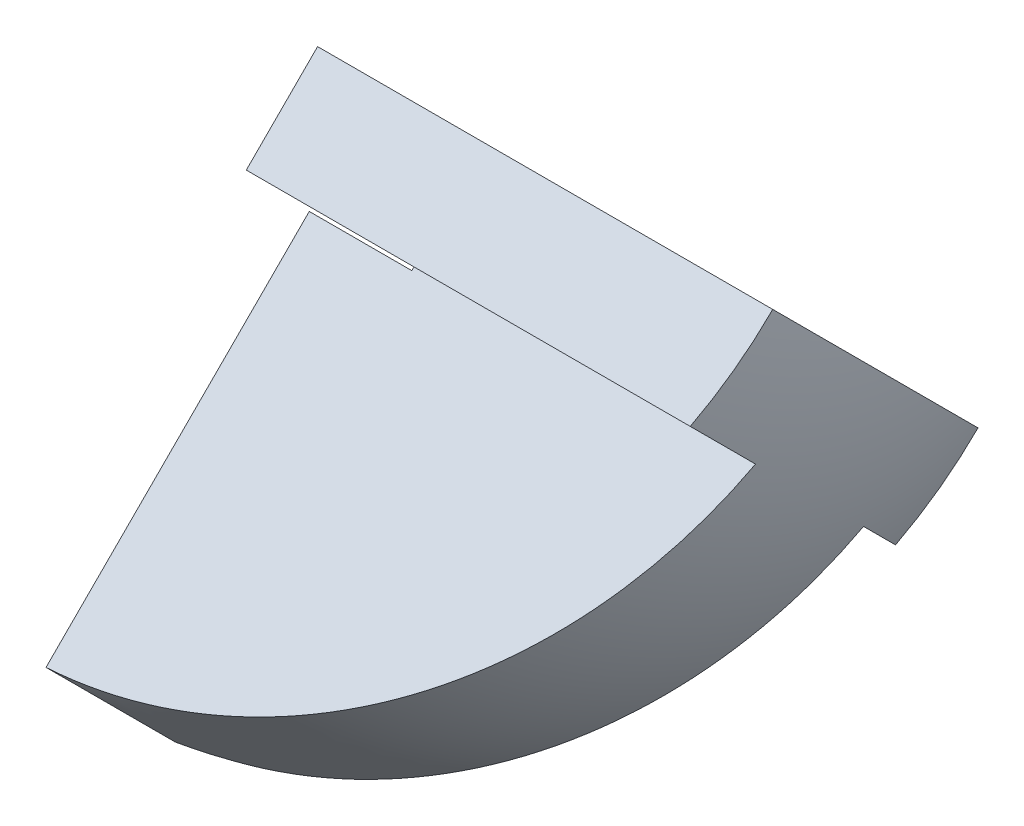
ISO-10303-21;
HEADER;
FILE_DESCRIPTION(('STEP AP214'),'2;1');
FILE_NAME('part.step','',(''),(''),'','','');
FILE_SCHEMA(('AUTOMOTIVE_DESIGN { 1 0 10303 214 1 1 1 1 }'));
ENDSEC;
DATA;
#1=APPLICATION_CONTEXT('core data for automotive mechanical design processes');
#2=APPLICATION_PROTOCOL_DEFINITION('international standard','automotive_design',2000,#1);
#3=PRODUCT_CONTEXT('',#1,'mechanical');
#4=PRODUCT('Part','Part','',(#3));
#5=PRODUCT_RELATED_PRODUCT_CATEGORY('part','',(#4));
#6=PRODUCT_DEFINITION_FORMATION('','',#4);
#7=PRODUCT_DEFINITION_CONTEXT('part definition',#1,'design');
#8=PRODUCT_DEFINITION('design','',#6,#7);
#9=PRODUCT_DEFINITION_SHAPE('','',#8);
#10=(LENGTH_UNIT() NAMED_UNIT(*) SI_UNIT(.MILLI.,.METRE.));
#11=(NAMED_UNIT(*) PLANE_ANGLE_UNIT() SI_UNIT($,.RADIAN.));
#12=(NAMED_UNIT(*) SI_UNIT($,.STERADIAN.) SOLID_ANGLE_UNIT());
#13=UNCERTAINTY_MEASURE_WITH_UNIT(LENGTH_MEASURE(1.E-05),#10,'distance_accuracy_value','');
#14=(GEOMETRIC_REPRESENTATION_CONTEXT(3) GLOBAL_UNCERTAINTY_ASSIGNED_CONTEXT((#13)) GLOBAL_UNIT_ASSIGNED_CONTEXT((#10,
#11,#12)) REPRESENTATION_CONTEXT('',''));
#15=CARTESIAN_POINT('',(0.,0.,0.));
#16=DIRECTION('',(0.,0.,1.));
#17=DIRECTION('',(1.,0.,0.));
#18=AXIS2_PLACEMENT_3D('',#15,#16,#17);
#19=CARTESIAN_POINT('',(-65.,-21.4342694425522,76.0704710401193));
#20=DIRECTION('',(0.,1.,0.));
#21=DIRECTION('',(0.,0.,-1.));
#22=AXIS2_PLACEMENT_3D('',#19,#20,#21);
#23=SPHERICAL_SURFACE('',#22,19.75);
#24=CARTESIAN_POINT('',(-65.,-24.3510849149467,78.9872865125137));
#25=DIRECTION('',(0.,-0.707106781186555,0.70710678118654));
#26=DIRECTION('',(0.,-0.70710678118654,-0.707106781186555));
#27=AXIS2_PLACEMENT_3D('',#24,#25,#26);
#28=CIRCLE('',#27,19.3144214254531);
#29=CARTESIAN_POINT('',(-46.6207509822457,-20.1528662127245,83.185505214736));
#30=VERTEX_POINT('',#29);
#31=CARTESIAN_POINT('',(-45.9400616475289,-22.1413762237388,81.1969952037217));
#32=VERTEX_POINT('',#31);
#33=EDGE_CURVE('E178',#30,#32,#28,.F.);
#34=ORIENTED_EDGE('',*,*,#33,.T.);
#35=CARTESIAN_POINT('',(-65.,-19.2245607513442,78.2801797313273));
#36=DIRECTION('',(0.,0.70710678118654,0.707106781186555));
#37=DIRECTION('',(0.,-0.707106781186555,0.70710678118654));
#38=AXIS2_PLACEMENT_3D('',#35,#36,#37);
#39=CIRCLE('',#38,19.5012018860377);
#40=CARTESIAN_POINT('',(-64.107321446432,-32.9995380653003,92.0551570452831));
#41=VERTEX_POINT('',#40);
#42=EDGE_CURVE('E185',#32,#41,#39,.F.);
#43=ORIENTED_EDGE('',*,*,#42,.T.);
#44=CARTESIAN_POINT('',(-65.,-35.2092467565082,89.8454483540751));
#45=DIRECTION('',(0.,0.707106781186551,-0.707106781186544));
#46=DIRECTION('',(0.,0.707106781186544,0.707106781186551));
#47=AXIS2_PLACEMENT_3D('',#44,#45,#46);
#48=CIRCLE('',#47,3.25000000000001);
#49=CARTESIAN_POINT('',(-64.1087574721216,-37.4192452583744,87.635449852209));
#50=VERTEX_POINT('',#49);
#51=EDGE_CURVE('E202',#50,#41,#48,.F.);
#52=ORIENTED_EDGE('',*,*,#51,.F.);
#53=CARTESIAN_POINT('',(-65.,-23.5919807676195,73.898563616899));
#54=DIRECTION('',(0.,-0.704784507451607,-0.709421453056077));
#55=DIRECTION('',(0.,0.709421453056077,-0.704784507451607));
#56=AXIS2_PLACEMENT_3D('',#53,#54,#55);
#57=CIRCLE('',#56,19.5112685385302);
#58=CARTESIAN_POINT('',(-62.6227242619556,-37.3305671000678,87.5473513152188));
#59=VERTEX_POINT('',#58);
#60=EDGE_CURVE('E196',#50,#59,#57,.F.);
#61=ORIENTED_EDGE('',*,*,#60,.T.);
#62=CARTESIAN_POINT('',(-65.,-23.6439781337602,73.8607623489113));
#63=DIRECTION('',(0.,-0.707106781186544,-0.707106781186551));
#64=DIRECTION('',(0.,0.707106781186551,-0.707106781186544));
#65=AXIS2_PLACEMENT_3D('',#62,#63,#64);
#66=CIRCLE('',#65,19.5012018860377);
#67=CARTESIAN_POINT('',(-45.9400616475289,-26.5607936061547,76.7775778213058));
#68=VERTEX_POINT('',#67);
#69=EDGE_CURVE('E193',#59,#68,#66,.F.);
#70=ORIENTED_EDGE('',*,*,#69,.T.);
#71=CARTESIAN_POINT('',(-65.,-24.3510849149467,78.9872865125138));
#72=DIRECTION('',(0.,-0.70710678118655,0.707106781186545));
#73=DIRECTION('',(0.,-0.707106781186545,-0.70710678118655));
#74=AXIS2_PLACEMENT_3D('',#71,#72,#73);
#75=CIRCLE('',#74,19.3144214254531);
#76=CARTESIAN_POINT('',(-46.6207509822457,-28.549303617169,74.7890678102915));
#77=VERTEX_POINT('',#76);
#78=EDGE_CURVE('E137',#68,#77,#75,.F.);
#79=ORIENTED_EDGE('',*,*,#78,.T.);
#80=CARTESIAN_POINT('',(-65.,-25.6324881447745,71.872252337897));
#81=DIRECTION('',(0.,-0.707106781186547,-0.707106781186547));
#82=DIRECTION('',(0.,0.707106781186548,-0.707106781186548));
#83=AXIS2_PLACEMENT_3D('',#80,#81,#82);
#84=CIRCLE('',#83,18.8364651529055);
#85=CARTESIAN_POINT('',(-46.1635348470945,-25.6324881447745,71.8722523378971));
#86=VERTEX_POINT('',#85);
#87=EDGE_CURVE('E124',#77,#86,#84,.F.);
#88=ORIENTED_EDGE('',*,*,#87,.T.);
#89=CARTESIAN_POINT('',(-65.,-21.4342694425522,76.0704710401193));
#90=DIRECTION('',(0.,-0.707106781186551,0.707106781186544));
#91=DIRECTION('',(0.,-0.707106781186544,-0.707106781186551));
#92=AXIS2_PLACEMENT_3D('',#89,#90,#91);
#93=CIRCLE('',#92,19.75);
#94=CARTESIAN_POINT('',(-46.1635348470945,-17.23605074033,80.2686897423416));
#95=VERTEX_POINT('',#94);
#96=EDGE_CURVE('E130',#95,#86,#93,.F.);
#97=ORIENTED_EDGE('',*,*,#96,.F.);
#98=CARTESIAN_POINT('',(-65.,-17.23605074033,80.2686897423416));
#99=DIRECTION('',(0.,0.707106781186543,0.707106781186552));
#100=DIRECTION('',(0.,-0.707106781186552,0.707106781186543));
#101=AXIS2_PLACEMENT_3D('',#98,#99,#100);
#102=CIRCLE('',#101,18.8364651529055);
#103=EDGE_CURVE('E57',#95,#30,#102,.F.);
#104=ORIENTED_EDGE('',*,*,#103,.T.);
#105=EDGE_LOOP('',(#34,#43,#52,#61,#70,#79,#88,#97,#104));
#106=FACE_BOUND('',#105,.T.);
#107=ADVANCED_FACE('F35',(#106),#23,.T.);
#108=CARTESIAN_POINT('',(-65.,-41.1842694425523,95.8204710401192));
#109=DIRECTION('',(0.,0.707106781186551,-0.707106781186544));
#110=DIRECTION('',(0.,0.707106781186544,0.707106781186551));
#111=AXIS2_PLACEMENT_3D('',#108,#109,#110);
#112=CYLINDRICAL_SURFACE('',#111,3.25000000000001);
#113=DIRECTION('',(0.,0.707106781186551,-0.707106781186544));
#114=VECTOR('',#113,1.);
#115=CARTESIAN_POINT('',(-64.107321446432,-38.9745607513444,98.0301797313271));
#116=LINE('',#115,#114);
#117=CARTESIAN_POINT('',(-64.1073214464324,-22.2297645713871,81.2853835513701));
#118=VERTEX_POINT('',#117);
#119=EDGE_CURVE('E183',#118,#41,#116,.F.);
#120=ORIENTED_EDGE('',*,*,#119,.F.);
#121=CARTESIAN_POINT('',(-65.,-24.4394732625951,79.0756748601621));
#122=DIRECTION('',(0.,0.707106781186552,-0.707106781186543));
#123=DIRECTION('',(0.,0.707106781186543,0.707106781186552));
#124=AXIS2_PLACEMENT_3D('',#121,#122,#123);
#125=CIRCLE('',#124,3.25000000000001);
#126=CARTESIAN_POINT('',(-64.1073214464322,-26.649181953803,76.8659661689541));
#127=VERTEX_POINT('',#126);
#128=EDGE_CURVE('E199',#118,#127,#125,.T.);
#129=ORIENTED_EDGE('',*,*,#128,.T.);
#130=DIRECTION('',(0.,0.707106781186551,-0.707106781186544));
#131=VECTOR('',#130,1.);
#132=CARTESIAN_POINT('',(-64.1073214464321,-43.3939781337603,93.6107623489112));
#133=LINE('',#132,#131);
#134=CARTESIAN_POINT('',(-64.1073214464321,-37.3305671000678,87.5473513152188));
#135=VERTEX_POINT('',#134);
#136=EDGE_CURVE('E191',#135,#127,#133,.T.);
#137=ORIENTED_EDGE('',*,*,#136,.F.);
#138=CARTESIAN_POINT('',(-65.,638.810532782176,-584.174331184602));
#139=DIRECTION('',(0.,-0.704784507451607,-0.709421453056077));
#140=DIRECTION('',(0.,0.709421453056077,-0.704784507451607));
#141=AXIS2_PLACEMENT_3D('',#138,#139,#140);
#142=ELLIPSE('',#141,991.211558162383,3.25000000000001);
#143=EDGE_CURVE('E12',#50,#135,#142,.F.);
#144=ORIENTED_EDGE('',*,*,#143,.F.);
#145=ORIENTED_EDGE('',*,*,#51,.T.);
#146=EDGE_LOOP('',(#120,#129,#137,#144,#145));
#147=FACE_BOUND('',#146,.T.);
#148=ADVANCED_FACE('F250',(#147),#112,.F.);
#149=CARTESIAN_POINT('',(0.,-51.7575740613788,51.7575740613781));
#150=DIRECTION('',(0.,0.707106781186552,-0.707106781186543));
#151=DIRECTION('',(0.,0.707106781186543,0.707106781186552));
#152=AXIS2_PLACEMENT_3D('',#149,#150,#151);
#153=PLANE('',#152);
#154=ORIENTED_EDGE('',*,*,#128,.F.);
#155=DIRECTION('',(1.,0.,0.));
#156=VECTOR('',#155,1.);
#157=CARTESIAN_POINT('',(0.,-22.2297645713871,81.2853835513702));
#158=LINE('',#157,#156);
#159=CARTESIAN_POINT('',(-59.9126587736529,-22.2297645713871,81.2853835513701));
#160=VERTEX_POINT('',#159);
#161=EDGE_CURVE('E180',#118,#160,#158,.T.);
#162=ORIENTED_EDGE('',*,*,#161,.T.);
#163=DIRECTION('',(0.866025403784439,-0.353553390593271,-0.353553390593275));
#164=VECTOR('',#163,1.);
#165=CARTESIAN_POINT('',(-65.,-20.1528662127245,83.3622819100327));
#166=LINE('',#165,#164);
#167=CARTESIAN_POINT('',(-59.75,-22.2961697376598,81.2189783850974));
#168=VERTEX_POINT('',#167);
#169=EDGE_CURVE('E208',#160,#168,#166,.T.);
#170=ORIENTED_EDGE('',*,*,#169,.T.);
#171=DIRECTION('',(0.,-0.707106781186545,-0.70710678118655));
#172=VECTOR('',#171,1.);
#173=CARTESIAN_POINT('',(-59.75,-22.2961697376598,81.2189783850974));
#174=LINE('',#173,#172);
#175=CARTESIAN_POINT('',(-59.75,-26.5827767875304,76.9323713352268));
#176=VERTEX_POINT('',#175);
#177=EDGE_CURVE('E211',#168,#176,#174,.T.);
#178=ORIENTED_EDGE('',*,*,#177,.T.);
#179=DIRECTION('',(-0.866025403784439,-0.353553390593271,-0.353553390593277));
#180=VECTOR('',#179,1.);
#181=CARTESIAN_POINT('',(-59.75,-26.5827767875304,76.9323713352268));
#182=LINE('',#181,#180);
#183=CARTESIAN_POINT('',(-59.9126587736527,-26.649181953803,76.8659661689541));
#184=VERTEX_POINT('',#183);
#185=EDGE_CURVE('E205',#176,#184,#182,.T.);
#186=ORIENTED_EDGE('',*,*,#185,.T.);
#187=DIRECTION('',(-1.,0.,0.));
#188=VECTOR('',#187,1.);
#189=CARTESIAN_POINT('',(0.,-26.6491819538031,76.8659661689542));
#190=LINE('',#189,#188);
#191=EDGE_CURVE('E188',#184,#127,#190,.T.);
#192=ORIENTED_EDGE('',*,*,#191,.T.);
#193=EDGE_LOOP('',(#154,#162,#170,#178,#186,#192));
#194=FACE_BOUND('',#193,.T.);
#195=ADVANCED_FACE('F227',(#194),#153,.T.);
#196=CARTESIAN_POINT('',(-59.75,-26.5827767875304,76.9323713352268));
#197=DIRECTION('',(0.5,-0.612372435695791,-0.612372435695798));
#198=DIRECTION('',(0.,0.707106781186551,-0.707106781186544));
#199=AXIS2_PLACEMENT_3D('',#196,#197,#198);
#200=PLANE('',#199);
#201=DIRECTION('',(0.,0.707106781186548,-0.707106781186548));
#202=VECTOR('',#201,1.);
#203=CARTESIAN_POINT('',(-64.7834936490538,-28.6376919648173,74.8774561579399));
#204=LINE('',#203,#202);
#205=CARTESIAN_POINT('',(-64.7834936490539,-28.549303617169,74.7890678102915));
#206=VERTEX_POINT('',#205);
#207=CARTESIAN_POINT('',(-64.7834936490539,-25.6324881447745,71.872252337897));
#208=VERTEX_POINT('',#207);
#209=EDGE_CURVE('E49',#206,#208,#204,.T.);
#210=ORIENTED_EDGE('',*,*,#209,.F.);
#211=DIRECTION('',(-0.866025403784439,-0.353553390593273,-0.353553390593275));
#212=VECTOR('',#211,1.);
#213=CARTESIAN_POINT('',(-59.75,-26.494388439882,76.8439829875785));
#214=LINE('',#213,#212);
#215=CARTESIAN_POINT('',(-59.9126587736527,-26.5607936061547,76.7775778213058));
#216=VERTEX_POINT('',#215);
#217=EDGE_CURVE('E42',#216,#206,#214,.T.);
#218=ORIENTED_EDGE('',*,*,#217,.F.);
#219=DIRECTION('',(0.,0.707106781186551,-0.707106781186544));
#220=VECTOR('',#219,1.);
#221=CARTESIAN_POINT('',(-59.9126587736527,-26.649181953803,76.8659661689541));
#222=LINE('',#221,#220);
#223=EDGE_CURVE('E154',#184,#216,#222,.T.);
#224=ORIENTED_EDGE('',*,*,#223,.F.);
#225=ORIENTED_EDGE('',*,*,#185,.F.);
#226=DIRECTION('',(0.,0.707106781186551,-0.707106781186544));
#227=VECTOR('',#226,1.);
#228=CARTESIAN_POINT('',(-59.75,-26.5827767875304,76.9323713352268));
#229=LINE('',#228,#227);
#230=CARTESIAN_POINT('',(-59.75,-23.5775729674875,73.927167515184));
#231=VERTEX_POINT('',#230);
#232=EDGE_CURVE('E142',#176,#231,#229,.T.);
#233=ORIENTED_EDGE('',*,*,#232,.T.);
#234=DIRECTION('',(-0.866025403784439,-0.353553390593271,-0.353553390593277));
#235=VECTOR('',#234,1.);
#236=CARTESIAN_POINT('',(-59.75,-23.5775729674875,73.927167515184));
#237=LINE('',#236,#235);
#238=EDGE_CURVE('E167',#231,#208,#237,.T.);
#239=ORIENTED_EDGE('',*,*,#238,.T.);
#240=EDGE_LOOP('',(#210,#218,#224,#225,#233,#239));
#241=FACE_BOUND('',#240,.T.);
#242=ADVANCED_FACE('F166',(#241),#200,.F.);
#243=CARTESIAN_POINT('',(-65.,-20.1528662127245,83.3622819100327));
#244=DIRECTION('',(0.499999999999999,0.612372435695791,0.612372435695798));
#245=DIRECTION('',(0.,-0.707106781186551,0.707106781186544));
#246=AXIS2_PLACEMENT_3D('',#243,#244,#245);
#247=PLANE('',#246);
#248=DIRECTION('',(0.,-0.707106781186555,0.70710678118654));
#249=VECTOR('',#248,1.);
#250=CARTESIAN_POINT('',(-59.9126587736529,-22.229764571387,81.2853835513701));
#251=LINE('',#250,#249);
#252=CARTESIAN_POINT('',(-59.9126587736527,-22.1413762237388,81.1969952037217));
#253=VERTEX_POINT('',#252);
#254=EDGE_CURVE('E152',#253,#160,#251,.T.);
#255=ORIENTED_EDGE('',*,*,#254,.F.);
#256=DIRECTION('',(0.866025403784439,-0.35355339059327,-0.353553390593277));
#257=VECTOR('',#256,1.);
#258=CARTESIAN_POINT('',(-65.,-20.0644778650762,83.2738935623844));
#259=LINE('',#258,#257);
#260=CARTESIAN_POINT('',(-64.7834936490539,-20.1528662127245,83.185505214736));
#261=VERTEX_POINT('',#260);
#262=EDGE_CURVE('E150',#261,#253,#259,.T.);
#263=ORIENTED_EDGE('',*,*,#262,.F.);
#264=DIRECTION('',(0.,-0.707106781186552,0.707106781186543));
#265=VECTOR('',#264,1.);
#266=CARTESIAN_POINT('',(-64.7834936490539,-20.2412545603729,83.2738935623844));
#267=LINE('',#266,#265);
#268=CARTESIAN_POINT('',(-64.7834936490539,-17.23605074033,80.2686897423416));
#269=VERTEX_POINT('',#268);
#270=EDGE_CURVE('E138',#269,#261,#267,.T.);
#271=ORIENTED_EDGE('',*,*,#270,.F.);
#272=DIRECTION('',(0.866025403784439,-0.353553390593271,-0.353553390593275));
#273=VECTOR('',#272,1.);
#274=CARTESIAN_POINT('',(-65.,-17.1476623926817,80.3570780899899));
#275=LINE('',#274,#273);
#276=CARTESIAN_POINT('',(-59.75,-19.290965917617,78.2137745650546));
#277=VERTEX_POINT('',#276);
#278=EDGE_CURVE('E215',#269,#277,#275,.T.);
#279=ORIENTED_EDGE('',*,*,#278,.T.);
#280=DIRECTION('',(0.,0.707106781186551,-0.707106781186544));
#281=VECTOR('',#280,1.);
#282=CARTESIAN_POINT('',(-59.75,-22.2961697376598,81.2189783850974));
#283=LINE('',#282,#281);
#284=EDGE_CURVE('E145',#168,#277,#283,.T.);
#285=ORIENTED_EDGE('',*,*,#284,.F.);
#286=ORIENTED_EDGE('',*,*,#169,.F.);
#287=EDGE_LOOP('',(#255,#263,#271,#279,#285,#286));
#288=FACE_BOUND('',#287,.T.);
#289=ADVANCED_FACE('F231',(#288),#247,.F.);
#290=CARTESIAN_POINT('',(-45.25,-17.1476623926817,80.3570780899899));
#291=DIRECTION('',(0.,-0.707106781186551,0.707106781186544));
#292=DIRECTION('',(0.,-0.707106781186544,-0.707106781186551));
#293=AXIS2_PLACEMENT_3D('',#290,#291,#292);
#294=PLANE('',#293);
#295=DIRECTION('',(-1.,0.,0.));
#296=VECTOR('',#295,1.);
#297=CARTESIAN_POINT('',(-45.25,-17.23605074033,80.2686897423416));
#298=LINE('',#297,#296);
#299=EDGE_CURVE('E129',#95,#269,#298,.T.);
#300=ORIENTED_EDGE('',*,*,#299,.F.);
#301=ORIENTED_EDGE('',*,*,#96,.T.);
#302=DIRECTION('',(1.,0.,0.));
#303=VECTOR('',#302,1.);
#304=CARTESIAN_POINT('',(-45.25,-25.6324881447745,71.872252337897));
#305=LINE('',#304,#303);
#306=EDGE_CURVE('E121',#208,#86,#305,.T.);
#307=ORIENTED_EDGE('',*,*,#306,.F.);
#308=ORIENTED_EDGE('',*,*,#238,.F.);
#309=DIRECTION('',(0.,-0.707106781186545,-0.70710678118655));
#310=VECTOR('',#309,1.);
#311=CARTESIAN_POINT('',(-59.75,-19.290965917617,78.2137745650546));
#312=LINE('',#311,#310);
#313=EDGE_CURVE('E209',#277,#231,#312,.T.);
#314=ORIENTED_EDGE('',*,*,#313,.F.);
#315=ORIENTED_EDGE('',*,*,#278,.F.);
#316=EDGE_LOOP('',(#300,#301,#307,#308,#314,#315));
#317=FACE_BOUND('',#316,.T.);
#318=ADVANCED_FACE('F140',(#317),#294,.F.);
#319=CARTESIAN_POINT('',(-59.75,-22.2961697376598,81.2189783850974));
#320=DIRECTION('',(1.,0.,0.));
#321=DIRECTION('',(0.,0.,-1.));
#322=AXIS2_PLACEMENT_3D('',#319,#320,#321);
#323=PLANE('',#322);
#324=ORIENTED_EDGE('',*,*,#313,.T.);
#325=ORIENTED_EDGE('',*,*,#232,.F.);
#326=ORIENTED_EDGE('',*,*,#177,.F.);
#327=ORIENTED_EDGE('',*,*,#284,.T.);
#328=EDGE_LOOP('',(#324,#325,#326,#327));
#329=FACE_BOUND('',#328,.T.);
#330=ADVANCED_FACE('F221',(#329),#323,.F.);
#331=CARTESIAN_POINT('',(-65.,-25.7208764924228,71.9606406855453));
#332=DIRECTION('',(0.,-0.707106781186547,-0.707106781186547));
#333=DIRECTION('',(0.,0.707106781186548,-0.707106781186548));
#334=AXIS2_PLACEMENT_3D('',#331,#332,#333);
#335=PLANE('',#334);
#336=DIRECTION('',(1.,0.,0.));
#337=VECTOR('',#336,1.);
#338=CARTESIAN_POINT('',(-65.,-28.549303617169,74.7890678102915));
#339=LINE('',#338,#337);
#340=EDGE_CURVE('E159',#206,#77,#339,.T.);
#341=ORIENTED_EDGE('',*,*,#340,.F.);
#342=ORIENTED_EDGE('',*,*,#209,.T.);
#343=ORIENTED_EDGE('',*,*,#306,.T.);
#344=ORIENTED_EDGE('',*,*,#87,.F.);
#345=EDGE_LOOP('',(#341,#342,#343,#344));
#346=FACE_BOUND('',#345,.T.);
#347=ADVANCED_FACE('F123',(#346),#335,.T.);
#348=CARTESIAN_POINT('',(-65.,-37.3305671000678,87.5473513152188));
#349=DIRECTION('',(0.,-0.707106781186544,-0.707106781186551));
#350=DIRECTION('',(0.,0.707106781186551,-0.707106781186544));
#351=AXIS2_PLACEMENT_3D('',#348,#349,#350);
#352=PLANE('',#351);
#353=DIRECTION('',(1.,0.,0.));
#354=VECTOR('',#353,1.);
#355=CARTESIAN_POINT('',(-65.,-37.3305671000678,87.5473513152188));
#356=LINE('',#355,#354);
#357=EDGE_CURVE('E173',#135,#59,#356,.T.);
#358=ORIENTED_EDGE('',*,*,#357,.F.);
#359=ORIENTED_EDGE('',*,*,#136,.T.);
#360=ORIENTED_EDGE('',*,*,#191,.F.);
#361=ORIENTED_EDGE('',*,*,#223,.T.);
#362=DIRECTION('',(1.,0.,0.));
#363=VECTOR('',#362,1.);
#364=CARTESIAN_POINT('',(-65.,-26.5607936061547,76.7775778213058));
#365=LINE('',#364,#363);
#366=EDGE_CURVE('E161',#216,#68,#365,.T.);
#367=ORIENTED_EDGE('',*,*,#366,.T.);
#368=ORIENTED_EDGE('',*,*,#69,.F.);
#369=EDGE_LOOP('',(#358,#359,#360,#361,#367,#368));
#370=FACE_BOUND('',#369,.T.);
#371=ADVANCED_FACE('F251',(#370),#352,.T.);
#372=CARTESIAN_POINT('',(-65.,-26.5607936061547,76.7775778213058));
#373=DIRECTION('',(0.,-0.70710678118655,0.707106781186545));
#374=DIRECTION('',(0.,-0.707106781186545,-0.70710678118655));
#375=AXIS2_PLACEMENT_3D('',#372,#373,#374);
#376=PLANE('',#375);
#377=ORIENTED_EDGE('',*,*,#366,.F.);
#378=ORIENTED_EDGE('',*,*,#217,.T.);
#379=ORIENTED_EDGE('',*,*,#340,.T.);
#380=ORIENTED_EDGE('',*,*,#78,.F.);
#381=EDGE_LOOP('',(#377,#378,#379,#380));
#382=FACE_BOUND('',#381,.T.);
#383=ADVANCED_FACE('F158',(#382),#376,.T.);
#384=CARTESIAN_POINT('',(-65.,-37.3305671000678,87.5473513152188));
#385=DIRECTION('',(0.,-0.704784507451607,-0.709421453056077));
#386=DIRECTION('',(0.,0.709421453056077,-0.704784507451607));
#387=AXIS2_PLACEMENT_3D('',#384,#385,#386);
#388=PLANE('',#387);
#389=ORIENTED_EDGE('',*,*,#143,.T.);
#390=ORIENTED_EDGE('',*,*,#357,.T.);
#391=ORIENTED_EDGE('',*,*,#60,.F.);
#392=EDGE_LOOP('',(#389,#390,#391));
#393=FACE_BOUND('',#392,.T.);
#394=ADVANCED_FACE('F244',(#393),#388,.T.);
#395=CARTESIAN_POINT('',(-65.,-20.1528662127245,83.185505214736));
#396=DIRECTION('',(0.,-0.707106781186555,0.70710678118654));
#397=DIRECTION('',(0.,-0.70710678118654,-0.707106781186555));
#398=AXIS2_PLACEMENT_3D('',#395,#396,#397);
#399=PLANE('',#398);
#400=DIRECTION('',(1.,0.,0.));
#401=VECTOR('',#400,1.);
#402=CARTESIAN_POINT('',(-65.,-20.1528662127245,83.185505214736));
#403=LINE('',#402,#401);
#404=EDGE_CURVE('E164',#261,#30,#403,.T.);
#405=ORIENTED_EDGE('',*,*,#404,.F.);
#406=ORIENTED_EDGE('',*,*,#262,.T.);
#407=DIRECTION('',(1.,0.,0.));
#408=VECTOR('',#407,1.);
#409=CARTESIAN_POINT('',(-65.,-22.1413762237388,81.1969952037217));
#410=LINE('',#409,#408);
#411=EDGE_CURVE('E168',#253,#32,#410,.T.);
#412=ORIENTED_EDGE('',*,*,#411,.T.);
#413=ORIENTED_EDGE('',*,*,#33,.F.);
#414=EDGE_LOOP('',(#405,#406,#412,#413));
#415=FACE_BOUND('',#414,.T.);
#416=ADVANCED_FACE('F237',(#415),#399,.T.);
#417=CARTESIAN_POINT('',(-65.,-17.3244390879783,80.3570780899899));
#418=DIRECTION('',(0.,0.707106781186543,0.707106781186552));
#419=DIRECTION('',(0.,-0.707106781186552,0.707106781186543));
#420=AXIS2_PLACEMENT_3D('',#417,#418,#419);
#421=PLANE('',#420);
#422=ORIENTED_EDGE('',*,*,#299,.T.);
#423=ORIENTED_EDGE('',*,*,#270,.T.);
#424=ORIENTED_EDGE('',*,*,#404,.T.);
#425=ORIENTED_EDGE('',*,*,#103,.F.);
#426=EDGE_LOOP('',(#422,#423,#424,#425));
#427=FACE_BOUND('',#426,.T.);
#428=ADVANCED_FACE('F235',(#427),#421,.T.);
#429=CARTESIAN_POINT('',(-65.,-32.9111497176519,91.9667686976348));
#430=DIRECTION('',(0.,0.70710678118654,0.707106781186555));
#431=DIRECTION('',(0.,-0.707106781186555,0.70710678118654));
#432=AXIS2_PLACEMENT_3D('',#429,#430,#431);
#433=PLANE('',#432);
#434=ORIENTED_EDGE('',*,*,#411,.F.);
#435=ORIENTED_EDGE('',*,*,#254,.T.);
#436=ORIENTED_EDGE('',*,*,#161,.F.);
#437=ORIENTED_EDGE('',*,*,#119,.T.);
#438=ORIENTED_EDGE('',*,*,#42,.F.);
#439=EDGE_LOOP('',(#434,#435,#436,#437,#438));
#440=FACE_BOUND('',#439,.T.);
#441=ADVANCED_FACE('F333',(#440),#433,.T.);
#442=CLOSED_SHELL('',(#107,#148,#195,#242,#289,#318,#330,#347,#371,#383,#394,#416,#428,#441));
#443=MANIFOLD_SOLID_BREP('B2',#442);
#444=ADVANCED_BREP_SHAPE_REPRESENTATION('',(#18,#443),#14);
#445=SHAPE_DEFINITION_REPRESENTATION(#9,#444);
ENDSEC;
END-ISO-10303-21;
